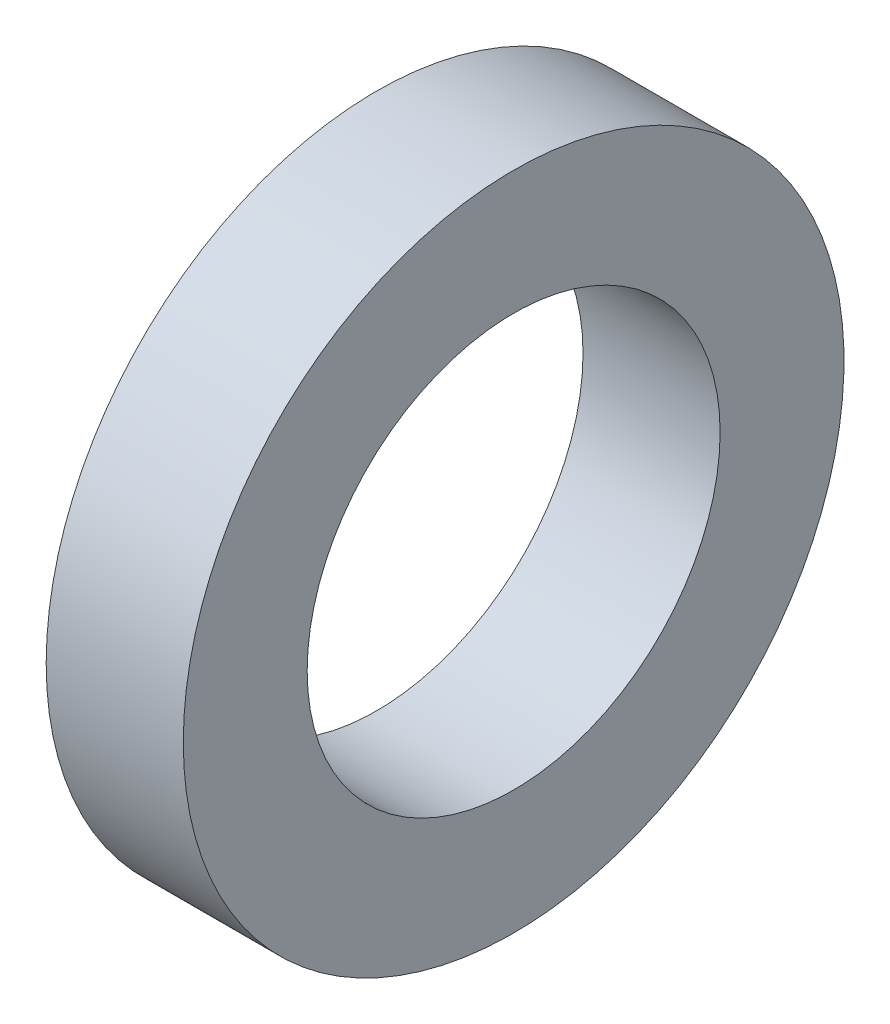
ISO-10303-21;
HEADER;
FILE_DESCRIPTION(('STEP AP214'),'2;1');
FILE_NAME('part.step','',(''),(''),'','','');
FILE_SCHEMA(('AUTOMOTIVE_DESIGN { 1 0 10303 214 1 1 1 1 }'));
ENDSEC;
DATA;
#1=APPLICATION_CONTEXT('core data for automotive mechanical design processes');
#2=APPLICATION_PROTOCOL_DEFINITION('international standard','automotive_design',2000,#1);
#3=PRODUCT_CONTEXT('',#1,'mechanical');
#4=PRODUCT('Part','Part','',(#3));
#5=PRODUCT_RELATED_PRODUCT_CATEGORY('part','',(#4));
#6=PRODUCT_DEFINITION_FORMATION('','',#4);
#7=PRODUCT_DEFINITION_CONTEXT('part definition',#1,'design');
#8=PRODUCT_DEFINITION('design','',#6,#7);
#9=PRODUCT_DEFINITION_SHAPE('','',#8);
#10=(LENGTH_UNIT() NAMED_UNIT(*) SI_UNIT(.MILLI.,.METRE.));
#11=(NAMED_UNIT(*) PLANE_ANGLE_UNIT() SI_UNIT($,.RADIAN.));
#12=(NAMED_UNIT(*) SI_UNIT($,.STERADIAN.) SOLID_ANGLE_UNIT());
#13=UNCERTAINTY_MEASURE_WITH_UNIT(LENGTH_MEASURE(1.E-05),#10,'distance_accuracy_value','');
#14=(GEOMETRIC_REPRESENTATION_CONTEXT(3) GLOBAL_UNCERTAINTY_ASSIGNED_CONTEXT((#13)) GLOBAL_UNIT_ASSIGNED_CONTEXT((#10,
#11,#12)) REPRESENTATION_CONTEXT('',''));
#15=CARTESIAN_POINT('',(0.,0.,0.));
#16=DIRECTION('',(0.,0.,1.));
#17=DIRECTION('',(1.,0.,0.));
#18=AXIS2_PLACEMENT_3D('',#15,#16,#17);
#19=CARTESIAN_POINT('',(18.039799836,7.499999986,0.));
#20=DIRECTION('',(1.,0.,0.));
#21=DIRECTION('',(0.,0.,-1.));
#22=AXIS2_PLACEMENT_3D('',#19,#20,#21);
#23=PLANE('',#22);
#24=CARTESIAN_POINT('',(18.039799836,0.,0.));
#25=DIRECTION('',(-1.,0.,0.));
#26=DIRECTION('',(0.,0.,1.));
#27=AXIS2_PLACEMENT_3D('',#24,#25,#26);
#28=CIRCLE('',#27,7.499999986);
#29=CARTESIAN_POINT('',(18.039799836,0.,7.499999986));
#30=VERTEX_POINT('',#29);
#31=EDGE_CURVE('E49',#30,#30,#28,.T.);
#32=ORIENTED_EDGE('',*,*,#31,.F.);
#33=EDGE_LOOP('',(#32));
#34=FACE_BOUND('',#33,.T.);
#35=CARTESIAN_POINT('',(18.039799836,0.,0.));
#36=DIRECTION('',(-1.,0.,0.));
#37=DIRECTION('',(0.,0.,1.));
#38=AXIS2_PLACEMENT_3D('',#35,#36,#37);
#39=CIRCLE('',#38,12.000000003);
#40=CARTESIAN_POINT('',(18.039799836,0.,12.000000003));
#41=VERTEX_POINT('',#40);
#42=EDGE_CURVE('E10',#41,#41,#39,.T.);
#43=ORIENTED_EDGE('',*,*,#42,.T.);
#44=EDGE_LOOP('',(#43));
#45=FACE_BOUND('',#44,.T.);
#46=ADVANCED_FACE('F35',(#34,#45),#23,.F.);
#47=CARTESIAN_POINT('',(0.,0.,0.));
#48=DIRECTION('',(-1.,0.,0.));
#49=DIRECTION('',(0.,0.,1.));
#50=AXIS2_PLACEMENT_3D('',#47,#48,#49);
#51=CYLINDRICAL_SURFACE('',#50,12.000000003);
#52=ORIENTED_EDGE('',*,*,#42,.F.);
#53=EDGE_LOOP('',(#52));
#54=FACE_BOUND('',#53,.T.);
#55=CARTESIAN_POINT('',(23.019799782,0.,0.));
#56=DIRECTION('',(-1.,0.,0.));
#57=DIRECTION('',(0.,0.,1.));
#58=AXIS2_PLACEMENT_3D('',#55,#56,#57);
#59=CIRCLE('',#58,12.000000003);
#60=CARTESIAN_POINT('',(23.019799782,0.,12.000000003));
#61=VERTEX_POINT('',#60);
#62=EDGE_CURVE('E41',#61,#61,#59,.T.);
#63=ORIENTED_EDGE('',*,*,#62,.T.);
#64=EDGE_LOOP('',(#63));
#65=FACE_BOUND('',#64,.T.);
#66=ADVANCED_FACE('F58',(#54,#65),#51,.T.);
#67=CARTESIAN_POINT('',(23.019799782,7.499999986,0.));
#68=DIRECTION('',(-1.,0.,0.));
#69=DIRECTION('',(0.,0.,1.));
#70=AXIS2_PLACEMENT_3D('',#67,#68,#69);
#71=PLANE('',#70);
#72=ORIENTED_EDGE('',*,*,#62,.F.);
#73=EDGE_LOOP('',(#72));
#74=FACE_BOUND('',#73,.T.);
#75=CARTESIAN_POINT('',(23.019799782,0.,0.));
#76=DIRECTION('',(-1.,0.,0.));
#77=DIRECTION('',(0.,0.,1.));
#78=AXIS2_PLACEMENT_3D('',#75,#76,#77);
#79=CIRCLE('',#78,7.499999986);
#80=CARTESIAN_POINT('',(23.019799782,0.,7.499999986));
#81=VERTEX_POINT('',#80);
#82=EDGE_CURVE('E45',#81,#81,#79,.T.);
#83=ORIENTED_EDGE('',*,*,#82,.T.);
#84=EDGE_LOOP('',(#83));
#85=FACE_BOUND('',#84,.T.);
#86=ADVANCED_FACE('F62',(#74,#85),#71,.F.);
#87=CARTESIAN_POINT('',(0.,0.,0.));
#88=DIRECTION('',(-1.,0.,0.));
#89=DIRECTION('',(0.,0.,1.));
#90=AXIS2_PLACEMENT_3D('',#87,#88,#89);
#91=CYLINDRICAL_SURFACE('',#90,7.499999986);
#92=ORIENTED_EDGE('',*,*,#82,.F.);
#93=EDGE_LOOP('',(#92));
#94=FACE_BOUND('',#93,.T.);
#95=ORIENTED_EDGE('',*,*,#31,.T.);
#96=EDGE_LOOP('',(#95));
#97=FACE_BOUND('',#96,.T.);
#98=ADVANCED_FACE('F55',(#94,#97),#91,.F.);
#99=CLOSED_SHELL('',(#46,#66,#86,#98));
#100=MANIFOLD_SOLID_BREP('B2',#99);
#101=ADVANCED_BREP_SHAPE_REPRESENTATION('',(#18,#100),#14);
#102=SHAPE_DEFINITION_REPRESENTATION(#9,#101);
ENDSEC;
END-ISO-10303-21;
